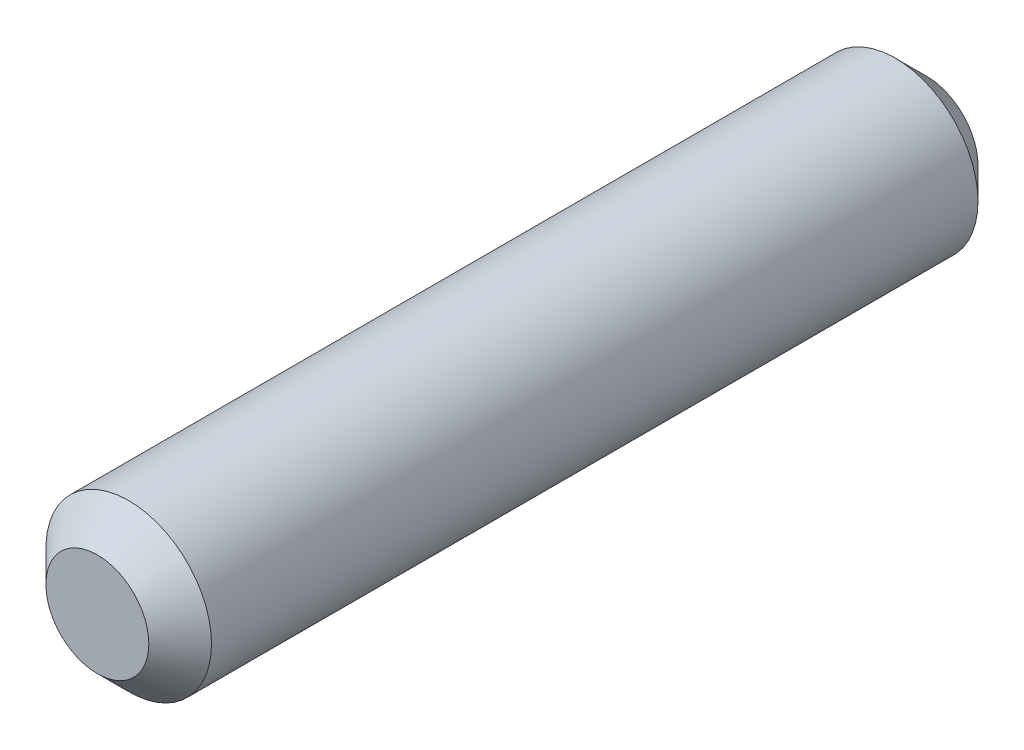
ISO-10303-21;
HEADER;
FILE_DESCRIPTION(('STEP AP214'),'2;1');
FILE_NAME('part.step','',(''),(''),'','','');
FILE_SCHEMA(('AUTOMOTIVE_DESIGN { 1 0 10303 214 1 1 1 1 }'));
ENDSEC;
DATA;
#1=APPLICATION_CONTEXT('core data for automotive mechanical design processes');
#2=APPLICATION_PROTOCOL_DEFINITION('international standard','automotive_design',2000,#1);
#3=PRODUCT_CONTEXT('',#1,'mechanical');
#4=PRODUCT('Part','Part','',(#3));
#5=PRODUCT_RELATED_PRODUCT_CATEGORY('part','',(#4));
#6=PRODUCT_DEFINITION_FORMATION('','',#4);
#7=PRODUCT_DEFINITION_CONTEXT('part definition',#1,'design');
#8=PRODUCT_DEFINITION('design','',#6,#7);
#9=PRODUCT_DEFINITION_SHAPE('','',#8);
#10=(LENGTH_UNIT() NAMED_UNIT(*) SI_UNIT(.MILLI.,.METRE.));
#11=(NAMED_UNIT(*) PLANE_ANGLE_UNIT() SI_UNIT($,.RADIAN.));
#12=(NAMED_UNIT(*) SI_UNIT($,.STERADIAN.) SOLID_ANGLE_UNIT());
#13=UNCERTAINTY_MEASURE_WITH_UNIT(LENGTH_MEASURE(1.E-05),#10,'distance_accuracy_value','');
#14=(GEOMETRIC_REPRESENTATION_CONTEXT(3) GLOBAL_UNCERTAINTY_ASSIGNED_CONTEXT((#13)) GLOBAL_UNIT_ASSIGNED_CONTEXT((#10,
#11,#12)) REPRESENTATION_CONTEXT('',''));
#15=CARTESIAN_POINT('',(0.,0.,0.));
#16=DIRECTION('',(0.,0.,1.));
#17=DIRECTION('',(1.,0.,0.));
#18=AXIS2_PLACEMENT_3D('',#15,#16,#17);
#19=CARTESIAN_POINT('',(0.,0.,7.935));
#20=DIRECTION('',(0.,0.,-1.));
#21=DIRECTION('',(-1.,0.,0.));
#22=AXIS2_PLACEMENT_3D('',#19,#20,#21);
#23=CYLINDRICAL_SURFACE('',#22,1.585);
#24=CARTESIAN_POINT('',(0.,0.,-7.335));
#25=DIRECTION('',(0.,0.,1.));
#26=DIRECTION('',(1.,0.,0.));
#27=AXIS2_PLACEMENT_3D('',#24,#25,#26);
#28=CIRCLE('',#27,1.585);
#29=CARTESIAN_POINT('',(1.585,0.,-7.335));
#30=VERTEX_POINT('',#29);
#31=EDGE_CURVE('E59',#30,#30,#28,.T.);
#32=ORIENTED_EDGE('',*,*,#31,.T.);
#33=EDGE_LOOP('',(#32));
#34=FACE_BOUND('',#33,.T.);
#35=CARTESIAN_POINT('',(0.,0.,7.335));
#36=DIRECTION('',(0.,0.,1.));
#37=DIRECTION('',(1.,0.,0.));
#38=AXIS2_PLACEMENT_3D('',#35,#36,#37);
#39=CIRCLE('',#38,1.585);
#40=CARTESIAN_POINT('',(1.585,0.,7.335));
#41=VERTEX_POINT('',#40);
#42=EDGE_CURVE('E64',#41,#41,#39,.F.);
#43=ORIENTED_EDGE('',*,*,#42,.T.);
#44=EDGE_LOOP('',(#43));
#45=FACE_BOUND('',#44,.T.);
#46=ADVANCED_FACE('F45',(#34,#45),#23,.T.);
#47=CARTESIAN_POINT('',(0.,0.,7.935));
#48=DIRECTION('',(0.,0.,1.));
#49=DIRECTION('',(1.,0.,0.));
#50=AXIS2_PLACEMENT_3D('',#47,#48,#49);
#51=PLANE('',#50);
#52=CARTESIAN_POINT('',(0.,0.,7.935));
#53=DIRECTION('',(0.,0.,1.));
#54=DIRECTION('',(1.,0.,0.));
#55=AXIS2_PLACEMENT_3D('',#52,#53,#54);
#56=CIRCLE('',#55,0.984999999999998);
#57=CARTESIAN_POINT('',(0.984999999999998,0.,7.935));
#58=VERTEX_POINT('',#57);
#59=EDGE_CURVE('E10',#58,#58,#56,.T.);
#60=ORIENTED_EDGE('',*,*,#59,.T.);
#61=EDGE_LOOP('',(#60));
#62=FACE_BOUND('',#61,.T.);
#63=ADVANCED_FACE('F81',(#62),#51,.T.);
#64=CARTESIAN_POINT('',(0.,0.,-7.935));
#65=DIRECTION('',(0.,0.,1.));
#66=DIRECTION('',(1.,0.,0.));
#67=AXIS2_PLACEMENT_3D('',#64,#65,#66);
#68=PLANE('',#67);
#69=CARTESIAN_POINT('',(0.,0.,-7.935));
#70=DIRECTION('',(0.,0.,1.));
#71=DIRECTION('',(1.,0.,0.));
#72=AXIS2_PLACEMENT_3D('',#69,#70,#71);
#73=CIRCLE('',#72,0.984999999999998);
#74=CARTESIAN_POINT('',(0.984999999999998,0.,-7.935));
#75=VERTEX_POINT('',#74);
#76=EDGE_CURVE('E54',#75,#75,#73,.F.);
#77=ORIENTED_EDGE('',*,*,#76,.T.);
#78=EDGE_LOOP('',(#77));
#79=FACE_BOUND('',#78,.T.);
#80=ADVANCED_FACE('F78',(#79),#68,.F.);
#81=CARTESIAN_POINT('',(0.,0.,-7.335));
#82=DIRECTION('',(0.,0.,1.));
#83=DIRECTION('',(1.,0.,0.));
#84=AXIS2_PLACEMENT_3D('',#81,#82,#83);
#85=CONICAL_SURFACE('',#84,1.585,0.785398163397447);
#86=ORIENTED_EDGE('',*,*,#76,.F.);
#87=EDGE_LOOP('',(#86));
#88=FACE_BOUND('',#87,.T.);
#89=ORIENTED_EDGE('',*,*,#31,.F.);
#90=EDGE_LOOP('',(#89));
#91=FACE_BOUND('',#90,.T.);
#92=ADVANCED_FACE('F74',(#88,#91),#85,.T.);
#93=CARTESIAN_POINT('',(0.,0.,7.935));
#94=DIRECTION('',(0.,0.,-1.));
#95=DIRECTION('',(-1.,0.,0.));
#96=AXIS2_PLACEMENT_3D('',#93,#94,#95);
#97=CONICAL_SURFACE('',#96,0.984999999999998,0.785398163397447);
#98=ORIENTED_EDGE('',*,*,#42,.F.);
#99=EDGE_LOOP('',(#98));
#100=FACE_BOUND('',#99,.T.);
#101=ORIENTED_EDGE('',*,*,#59,.F.);
#102=EDGE_LOOP('',(#101));
#103=FACE_BOUND('',#102,.T.);
#104=ADVANCED_FACE('F48',(#100,#103),#97,.T.);
#105=CLOSED_SHELL('',(#46,#63,#80,#92,#104));
#106=MANIFOLD_SOLID_BREP('B2',#105);
#107=ADVANCED_BREP_SHAPE_REPRESENTATION('',(#18,#106),#14);
#108=SHAPE_DEFINITION_REPRESENTATION(#9,#107);
ENDSEC;
END-ISO-10303-21;
